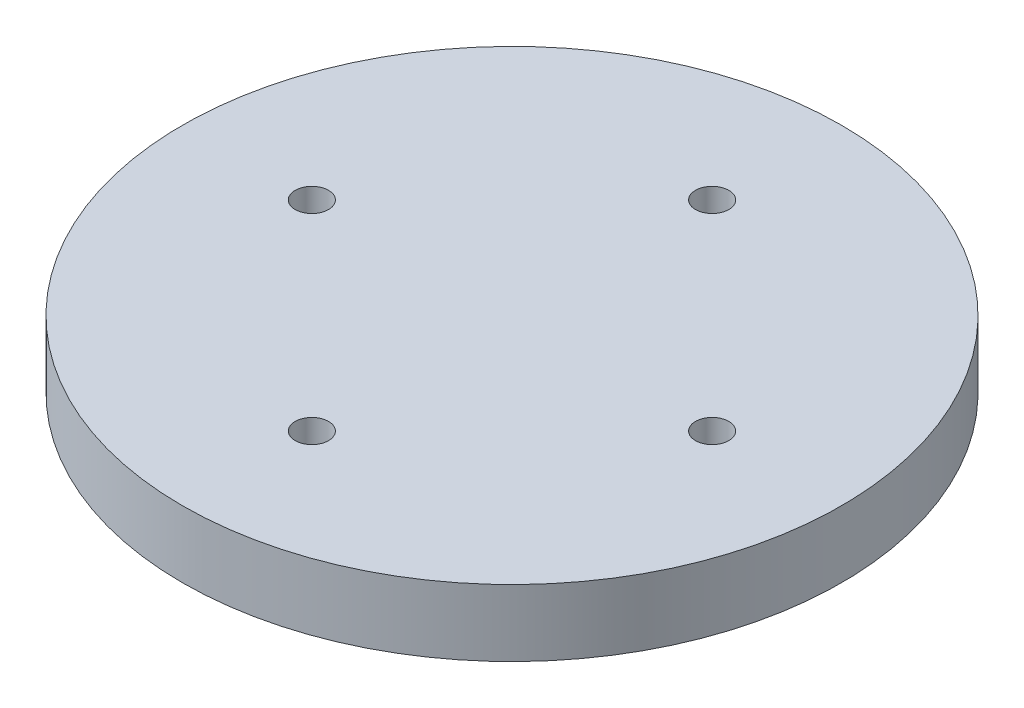
ISO-10303-21;
HEADER;
FILE_DESCRIPTION(('STEP AP214'),'2;1');
FILE_NAME('part.step','',(''),(''),'','','');
FILE_SCHEMA(('AUTOMOTIVE_DESIGN { 1 0 10303 214 1 1 1 1 }'));
ENDSEC;
DATA;
#1=APPLICATION_CONTEXT('core data for automotive mechanical design processes');
#2=APPLICATION_PROTOCOL_DEFINITION('international standard','automotive_design',2000,#1);
#3=PRODUCT_CONTEXT('',#1,'mechanical');
#4=PRODUCT('Part','Part','',(#3));
#5=PRODUCT_RELATED_PRODUCT_CATEGORY('part','',(#4));
#6=PRODUCT_DEFINITION_FORMATION('','',#4);
#7=PRODUCT_DEFINITION_CONTEXT('part definition',#1,'design');
#8=PRODUCT_DEFINITION('design','',#6,#7);
#9=PRODUCT_DEFINITION_SHAPE('','',#8);
#10=(LENGTH_UNIT() NAMED_UNIT(*) SI_UNIT(.MILLI.,.METRE.));
#11=(NAMED_UNIT(*) PLANE_ANGLE_UNIT() SI_UNIT($,.RADIAN.));
#12=(NAMED_UNIT(*) SI_UNIT($,.STERADIAN.) SOLID_ANGLE_UNIT());
#13=UNCERTAINTY_MEASURE_WITH_UNIT(LENGTH_MEASURE(1.E-05),#10,'distance_accuracy_value','');
#14=(GEOMETRIC_REPRESENTATION_CONTEXT(3) GLOBAL_UNCERTAINTY_ASSIGNED_CONTEXT((#13)) GLOBAL_UNIT_ASSIGNED_CONTEXT((#10,
#11,#12)) REPRESENTATION_CONTEXT('',''));
#15=CARTESIAN_POINT('',(0.,0.,0.));
#16=DIRECTION('',(0.,0.,1.));
#17=DIRECTION('',(1.,0.,0.));
#18=AXIS2_PLACEMENT_3D('',#15,#16,#17);
#19=CARTESIAN_POINT('',(0.,12.7,0.));
#20=DIRECTION('',(0.,-1.,0.));
#21=DIRECTION('',(0.,0.,-1.));
#22=AXIS2_PLACEMENT_3D('',#19,#20,#21);
#23=CYLINDRICAL_SURFACE('',#22,62.738);
#24=CARTESIAN_POINT('',(0.,12.7,0.));
#25=DIRECTION('',(0.,1.,0.));
#26=DIRECTION('',(0.,0.,1.));
#27=AXIS2_PLACEMENT_3D('',#24,#25,#26);
#28=CIRCLE('',#27,62.738);
#29=CARTESIAN_POINT('',(0.,12.7,62.738));
#30=VERTEX_POINT('',#29);
#31=EDGE_CURVE('E10',#30,#30,#28,.T.);
#32=ORIENTED_EDGE('',*,*,#31,.F.);
#33=EDGE_LOOP('',(#32));
#34=FACE_BOUND('',#33,.T.);
#35=CARTESIAN_POINT('',(0.,0.,0.));
#36=DIRECTION('',(0.,1.,0.));
#37=DIRECTION('',(0.,0.,1.));
#38=AXIS2_PLACEMENT_3D('',#35,#36,#37);
#39=CIRCLE('',#38,62.738);
#40=CARTESIAN_POINT('',(0.,0.,62.738));
#41=VERTEX_POINT('',#40);
#42=EDGE_CURVE('E34',#41,#41,#39,.T.);
#43=ORIENTED_EDGE('',*,*,#42,.T.);
#44=EDGE_LOOP('',(#43));
#45=FACE_BOUND('',#44,.T.);
#46=ADVANCED_FACE('F31',(#34,#45),#23,.T.);
#47=CARTESIAN_POINT('',(0.,12.7,0.));
#48=DIRECTION('',(0.,1.,0.));
#49=DIRECTION('',(0.,0.,1.));
#50=AXIS2_PLACEMENT_3D('',#47,#48,#49);
#51=PLANE('',#50);
#52=CARTESIAN_POINT('',(0.,12.7,38.1));
#53=DIRECTION('',(0.,1.,0.));
#54=DIRECTION('',(0.,0.,1.));
#55=AXIS2_PLACEMENT_3D('',#52,#53,#54);
#56=CIRCLE('',#55,3.17499999999999);
#57=CARTESIAN_POINT('',(0.,12.7,41.275));
#58=VERTEX_POINT('',#57);
#59=EDGE_CURVE('E61',#58,#58,#56,.T.);
#60=ORIENTED_EDGE('',*,*,#59,.F.);
#61=EDGE_LOOP('',(#60));
#62=FACE_BOUND('',#61,.T.);
#63=CARTESIAN_POINT('',(-38.1,12.7,0.));
#64=DIRECTION('',(0.,1.,0.));
#65=DIRECTION('',(0.,0.,1.));
#66=AXIS2_PLACEMENT_3D('',#63,#64,#65);
#67=CIRCLE('',#66,3.175);
#68=CARTESIAN_POINT('',(-38.1,12.7,3.17499999999999));
#69=VERTEX_POINT('',#68);
#70=EDGE_CURVE('E55',#69,#69,#67,.T.);
#71=ORIENTED_EDGE('',*,*,#70,.F.);
#72=EDGE_LOOP('',(#71));
#73=FACE_BOUND('',#72,.T.);
#74=CARTESIAN_POINT('',(0.,12.7,-38.1));
#75=DIRECTION('',(0.,1.,0.));
#76=DIRECTION('',(0.,0.,1.));
#77=AXIS2_PLACEMENT_3D('',#74,#75,#76);
#78=CIRCLE('',#77,3.17499999999999);
#79=CARTESIAN_POINT('',(0.,12.7,-34.925));
#80=VERTEX_POINT('',#79);
#81=EDGE_CURVE('E49',#80,#80,#78,.T.);
#82=ORIENTED_EDGE('',*,*,#81,.F.);
#83=EDGE_LOOP('',(#82));
#84=FACE_BOUND('',#83,.T.);
#85=CARTESIAN_POINT('',(38.1,12.7,0.));
#86=DIRECTION('',(0.,1.,0.));
#87=DIRECTION('',(0.,0.,1.));
#88=AXIS2_PLACEMENT_3D('',#85,#86,#87);
#89=CIRCLE('',#88,3.175);
#90=CARTESIAN_POINT('',(38.1,12.7,3.175));
#91=VERTEX_POINT('',#90);
#92=EDGE_CURVE('E43',#91,#91,#89,.T.);
#93=ORIENTED_EDGE('',*,*,#92,.F.);
#94=EDGE_LOOP('',(#93));
#95=FACE_BOUND('',#94,.T.);
#96=ORIENTED_EDGE('',*,*,#31,.T.);
#97=EDGE_LOOP('',(#96));
#98=FACE_BOUND('',#97,.T.);
#99=ADVANCED_FACE('F76',(#62,#73,#84,#95,#98),#51,.T.);
#100=CARTESIAN_POINT('',(0.,0.,0.));
#101=DIRECTION('',(0.,1.,0.));
#102=DIRECTION('',(0.,0.,1.));
#103=AXIS2_PLACEMENT_3D('',#100,#101,#102);
#104=PLANE('',#103);
#105=ORIENTED_EDGE('',*,*,#42,.F.);
#106=EDGE_LOOP('',(#105));
#107=FACE_BOUND('',#106,.T.);
#108=ADVANCED_FACE('F79',(#107),#104,.F.);
#109=CARTESIAN_POINT('',(38.1,6.35,0.));
#110=DIRECTION('',(0.,1.,0.));
#111=DIRECTION('',(0.,0.,1.));
#112=AXIS2_PLACEMENT_3D('',#109,#110,#111);
#113=CYLINDRICAL_SURFACE('',#112,3.175);
#114=CARTESIAN_POINT('',(38.1,6.35,0.));
#115=DIRECTION('',(0.,1.,0.));
#116=DIRECTION('',(0.,0.,1.));
#117=AXIS2_PLACEMENT_3D('',#114,#115,#116);
#118=CIRCLE('',#117,3.175);
#119=CARTESIAN_POINT('',(38.1,6.35,3.175));
#120=VERTEX_POINT('',#119);
#121=EDGE_CURVE('E41',#120,#120,#118,.T.);
#122=ORIENTED_EDGE('',*,*,#121,.F.);
#123=EDGE_LOOP('',(#122));
#124=FACE_BOUND('',#123,.T.);
#125=ORIENTED_EDGE('',*,*,#92,.T.);
#126=EDGE_LOOP('',(#125));
#127=FACE_BOUND('',#126,.T.);
#128=ADVANCED_FACE('F87',(#124,#127),#113,.F.);
#129=CARTESIAN_POINT('',(38.1,6.35,0.));
#130=DIRECTION('',(0.,1.,0.));
#131=DIRECTION('',(0.,0.,1.));
#132=AXIS2_PLACEMENT_3D('',#129,#130,#131);
#133=PLANE('',#132);
#134=ORIENTED_EDGE('',*,*,#121,.T.);
#135=EDGE_LOOP('',(#134));
#136=FACE_BOUND('',#135,.T.);
#137=ADVANCED_FACE('F89',(#136),#133,.T.);
#138=CARTESIAN_POINT('',(0.,6.35,-38.1));
#139=DIRECTION('',(0.,1.,0.));
#140=DIRECTION('',(0.,0.,1.));
#141=AXIS2_PLACEMENT_3D('',#138,#139,#140);
#142=CYLINDRICAL_SURFACE('',#141,3.17499999999999);
#143=CARTESIAN_POINT('',(0.,6.35,-38.1));
#144=DIRECTION('',(0.,1.,0.));
#145=DIRECTION('',(0.,0.,1.));
#146=AXIS2_PLACEMENT_3D('',#143,#144,#145);
#147=CIRCLE('',#146,3.17499999999999);
#148=CARTESIAN_POINT('',(0.,6.35,-34.925));
#149=VERTEX_POINT('',#148);
#150=EDGE_CURVE('E52',#149,#149,#147,.T.);
#151=ORIENTED_EDGE('',*,*,#150,.F.);
#152=EDGE_LOOP('',(#151));
#153=FACE_BOUND('',#152,.T.);
#154=ORIENTED_EDGE('',*,*,#81,.T.);
#155=EDGE_LOOP('',(#154));
#156=FACE_BOUND('',#155,.T.);
#157=ADVANCED_FACE('F96',(#153,#156),#142,.F.);
#158=CARTESIAN_POINT('',(0.,6.35,-38.1));
#159=DIRECTION('',(0.,1.,0.));
#160=DIRECTION('',(0.,0.,1.));
#161=AXIS2_PLACEMENT_3D('',#158,#159,#160);
#162=PLANE('',#161);
#163=ORIENTED_EDGE('',*,*,#150,.T.);
#164=EDGE_LOOP('',(#163));
#165=FACE_BOUND('',#164,.T.);
#166=ADVANCED_FACE('F136',(#165),#162,.T.);
#167=CARTESIAN_POINT('',(-38.1,6.35,0.));
#168=DIRECTION('',(0.,1.,0.));
#169=DIRECTION('',(0.,0.,1.));
#170=AXIS2_PLACEMENT_3D('',#167,#168,#169);
#171=CYLINDRICAL_SURFACE('',#170,3.175);
#172=CARTESIAN_POINT('',(-38.1,6.35,0.));
#173=DIRECTION('',(0.,1.,0.));
#174=DIRECTION('',(0.,0.,1.));
#175=AXIS2_PLACEMENT_3D('',#172,#173,#174);
#176=CIRCLE('',#175,3.175);
#177=CARTESIAN_POINT('',(-38.1,6.35,3.17499999999999));
#178=VERTEX_POINT('',#177);
#179=EDGE_CURVE('E58',#178,#178,#176,.T.);
#180=ORIENTED_EDGE('',*,*,#179,.F.);
#181=EDGE_LOOP('',(#180));
#182=FACE_BOUND('',#181,.T.);
#183=ORIENTED_EDGE('',*,*,#70,.T.);
#184=EDGE_LOOP('',(#183));
#185=FACE_BOUND('',#184,.T.);
#186=ADVANCED_FACE('F145',(#182,#185),#171,.F.);
#187=CARTESIAN_POINT('',(-38.1,6.35,0.));
#188=DIRECTION('',(0.,1.,0.));
#189=DIRECTION('',(0.,0.,1.));
#190=AXIS2_PLACEMENT_3D('',#187,#188,#189);
#191=PLANE('',#190);
#192=ORIENTED_EDGE('',*,*,#179,.T.);
#193=EDGE_LOOP('',(#192));
#194=FACE_BOUND('',#193,.T.);
#195=ADVANCED_FACE('F72',(#194),#191,.T.);
#196=CARTESIAN_POINT('',(0.,6.35,38.1));
#197=DIRECTION('',(0.,1.,0.));
#198=DIRECTION('',(0.,0.,1.));
#199=AXIS2_PLACEMENT_3D('',#196,#197,#198);
#200=CYLINDRICAL_SURFACE('',#199,3.17499999999999);
#201=CARTESIAN_POINT('',(0.,6.35,38.1));
#202=DIRECTION('',(0.,1.,0.));
#203=DIRECTION('',(0.,0.,1.));
#204=AXIS2_PLACEMENT_3D('',#201,#202,#203);
#205=CIRCLE('',#204,3.17499999999999);
#206=CARTESIAN_POINT('',(0.,6.35,41.275));
#207=VERTEX_POINT('',#206);
#208=EDGE_CURVE('E46',#207,#207,#205,.T.);
#209=ORIENTED_EDGE('',*,*,#208,.F.);
#210=EDGE_LOOP('',(#209));
#211=FACE_BOUND('',#210,.T.);
#212=ORIENTED_EDGE('',*,*,#59,.T.);
#213=EDGE_LOOP('',(#212));
#214=FACE_BOUND('',#213,.T.);
#215=ADVANCED_FACE('F69',(#211,#214),#200,.F.);
#216=CARTESIAN_POINT('',(0.,6.35,38.1));
#217=DIRECTION('',(0.,1.,0.));
#218=DIRECTION('',(0.,0.,1.));
#219=AXIS2_PLACEMENT_3D('',#216,#217,#218);
#220=PLANE('',#219);
#221=ORIENTED_EDGE('',*,*,#208,.T.);
#222=EDGE_LOOP('',(#221));
#223=FACE_BOUND('',#222,.T.);
#224=ADVANCED_FACE('F67',(#223),#220,.T.);
#225=CLOSED_SHELL('',(#46,#99,#108,#128,#137,#157,#166,#186,#195,#215,#224));
#226=MANIFOLD_SOLID_BREP('B2',#225);
#227=ADVANCED_BREP_SHAPE_REPRESENTATION('',(#18,#226),#14);
#228=SHAPE_DEFINITION_REPRESENTATION(#9,#227);
ENDSEC;
END-ISO-10303-21;
